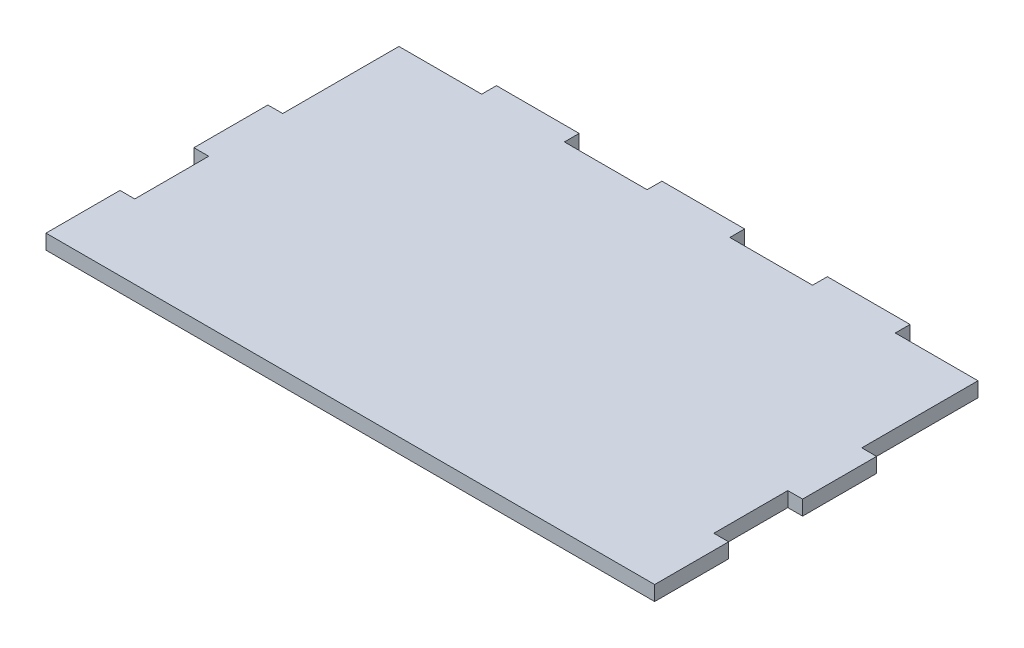
ISO-10303-21;
HEADER;
FILE_DESCRIPTION(('STEP AP214'),'2;1');
FILE_NAME('part.step','',(''),(''),'','','');
FILE_SCHEMA(('AUTOMOTIVE_DESIGN { 1 0 10303 214 1 1 1 1 }'));
ENDSEC;
DATA;
#1=APPLICATION_CONTEXT('core data for automotive mechanical design processes');
#2=APPLICATION_PROTOCOL_DEFINITION('international standard','automotive_design',2000,#1);
#3=PRODUCT_CONTEXT('',#1,'mechanical');
#4=PRODUCT('Part','Part','',(#3));
#5=PRODUCT_RELATED_PRODUCT_CATEGORY('part','',(#4));
#6=PRODUCT_DEFINITION_FORMATION('','',#4);
#7=PRODUCT_DEFINITION_CONTEXT('part definition',#1,'design');
#8=PRODUCT_DEFINITION('design','',#6,#7);
#9=PRODUCT_DEFINITION_SHAPE('','',#8);
#10=(LENGTH_UNIT() NAMED_UNIT(*) SI_UNIT(.MILLI.,.METRE.));
#11=(NAMED_UNIT(*) PLANE_ANGLE_UNIT() SI_UNIT($,.RADIAN.));
#12=(NAMED_UNIT(*) SI_UNIT($,.STERADIAN.) SOLID_ANGLE_UNIT());
#13=UNCERTAINTY_MEASURE_WITH_UNIT(LENGTH_MEASURE(1.E-05),#10,'distance_accuracy_value','');
#14=(GEOMETRIC_REPRESENTATION_CONTEXT(3) GLOBAL_UNCERTAINTY_ASSIGNED_CONTEXT((#13)) GLOBAL_UNIT_ASSIGNED_CONTEXT((#10,
#11,#12)) REPRESENTATION_CONTEXT('',''));
#15=CARTESIAN_POINT('',(0.,0.,0.));
#16=DIRECTION('',(0.,0.,1.));
#17=DIRECTION('',(1.,0.,0.));
#18=AXIS2_PLACEMENT_3D('',#15,#16,#17);
#19=CARTESIAN_POINT('',(0.,1.75,0.));
#20=DIRECTION('',(0.,0.,-1.));
#21=DIRECTION('',(-1.,0.,0.));
#22=AXIS2_PLACEMENT_3D('',#19,#20,#21);
#23=PLANE('',#22);
#24=DIRECTION('',(1.,0.,0.));
#25=VECTOR('',#24,1.);
#26=CARTESIAN_POINT('',(0.,0.,0.));
#27=LINE('',#26,#25);
#28=CARTESIAN_POINT('',(-1.75,0.,0.));
#29=VERTEX_POINT('',#28);
#30=CARTESIAN_POINT('',(70.25,0.,0.));
#31=VERTEX_POINT('',#30);
#32=EDGE_CURVE('E373',#29,#31,#27,.T.);
#33=ORIENTED_EDGE('',*,*,#32,.T.);
#34=DIRECTION('',(0.,-1.,0.));
#35=VECTOR('',#34,1.);
#36=CARTESIAN_POINT('',(70.25,1.75,0.));
#37=LINE('',#36,#35);
#38=CARTESIAN_POINT('',(70.25,1.75,0.));
#39=VERTEX_POINT('',#38);
#40=EDGE_CURVE('E11',#39,#31,#37,.T.);
#41=ORIENTED_EDGE('',*,*,#40,.F.);
#42=DIRECTION('',(1.,0.,0.));
#43=VECTOR('',#42,1.);
#44=CARTESIAN_POINT('',(0.,1.75,0.));
#45=LINE('',#44,#43);
#46=CARTESIAN_POINT('',(-1.75,1.75,0.));
#47=VERTEX_POINT('',#46);
#48=EDGE_CURVE('E439',#47,#39,#45,.T.);
#49=ORIENTED_EDGE('',*,*,#48,.F.);
#50=DIRECTION('',(0.,-1.,0.));
#51=VECTOR('',#50,1.);
#52=CARTESIAN_POINT('',(-1.75,1.75,0.));
#53=LINE('',#52,#51);
#54=EDGE_CURVE('E54',#47,#29,#53,.T.);
#55=ORIENTED_EDGE('',*,*,#54,.T.);
#56=EDGE_LOOP('',(#33,#41,#49,#55));
#57=FACE_BOUND('',#56,.T.);
#58=ADVANCED_FACE('F38',(#57),#23,.F.);
#59=CARTESIAN_POINT('',(70.25,1.75,0.));
#60=DIRECTION('',(-1.,0.,0.));
#61=DIRECTION('',(0.,0.,1.));
#62=AXIS2_PLACEMENT_3D('',#59,#60,#61);
#63=PLANE('',#62);
#64=DIRECTION('',(0.,0.,-1.));
#65=VECTOR('',#64,1.);
#66=CARTESIAN_POINT('',(70.25,0.,0.));
#67=LINE('',#66,#65);
#68=CARTESIAN_POINT('',(70.25,0.,-8.75));
#69=VERTEX_POINT('',#68);
#70=EDGE_CURVE('E369',#31,#69,#67,.T.);
#71=ORIENTED_EDGE('',*,*,#70,.T.);
#72=DIRECTION('',(0.,-1.,0.));
#73=VECTOR('',#72,1.);
#74=CARTESIAN_POINT('',(70.25,1.75,-8.75));
#75=LINE('',#74,#73);
#76=CARTESIAN_POINT('',(70.25,1.75,-8.75));
#77=VERTEX_POINT('',#76);
#78=EDGE_CURVE('E46',#77,#69,#75,.T.);
#79=ORIENTED_EDGE('',*,*,#78,.F.);
#80=DIRECTION('',(0.,0.,-1.));
#81=VECTOR('',#80,1.);
#82=CARTESIAN_POINT('',(70.25,1.75,0.));
#83=LINE('',#82,#81);
#84=EDGE_CURVE('E153',#39,#77,#83,.T.);
#85=ORIENTED_EDGE('',*,*,#84,.F.);
#86=ORIENTED_EDGE('',*,*,#40,.T.);
#87=EDGE_LOOP('',(#71,#79,#85,#86));
#88=FACE_BOUND('',#87,.T.);
#89=ADVANCED_FACE('F370',(#88),#63,.F.);
#90=CARTESIAN_POINT('',(0.,1.75,-8.75000000000028));
#91=DIRECTION('',(0.,0.,-1.));
#92=DIRECTION('',(-1.,0.,0.));
#93=AXIS2_PLACEMENT_3D('',#90,#91,#92);
#94=PLANE('',#93);
#95=DIRECTION('',(1.,0.,0.));
#96=VECTOR('',#95,1.);
#97=CARTESIAN_POINT('',(0.,0.,-8.75000000000028));
#98=LINE('',#97,#96);
#99=CARTESIAN_POINT('',(68.5,0.,-8.75));
#100=VERTEX_POINT('',#99);
#101=EDGE_CURVE('E366',#100,#69,#98,.T.);
#102=ORIENTED_EDGE('',*,*,#101,.F.);
#103=DIRECTION('',(0.,-1.,0.));
#104=VECTOR('',#103,1.);
#105=CARTESIAN_POINT('',(68.5,1.75,-8.75));
#106=LINE('',#105,#104);
#107=CARTESIAN_POINT('',(68.5,1.75,-8.75));
#108=VERTEX_POINT('',#107);
#109=EDGE_CURVE('E359',#108,#100,#106,.T.);
#110=ORIENTED_EDGE('',*,*,#109,.F.);
#111=DIRECTION('',(1.,0.,0.));
#112=VECTOR('',#111,1.);
#113=CARTESIAN_POINT('',(0.,1.75,-8.75000000000028));
#114=LINE('',#113,#112);
#115=EDGE_CURVE('E368',#108,#77,#114,.T.);
#116=ORIENTED_EDGE('',*,*,#115,.T.);
#117=ORIENTED_EDGE('',*,*,#78,.T.);
#118=EDGE_LOOP('',(#102,#110,#116,#117));
#119=FACE_BOUND('',#118,.T.);
#120=ADVANCED_FACE('F364',(#119),#94,.T.);
#121=CARTESIAN_POINT('',(68.5,1.75,0.));
#122=DIRECTION('',(-1.,0.,0.));
#123=DIRECTION('',(0.,0.,1.));
#124=AXIS2_PLACEMENT_3D('',#121,#122,#123);
#125=PLANE('',#124);
#126=DIRECTION('',(0.,0.,-1.));
#127=VECTOR('',#126,1.);
#128=CARTESIAN_POINT('',(68.5,0.,0.));
#129=LINE('',#128,#127);
#130=CARTESIAN_POINT('',(68.5,0.,-17.5));
#131=VERTEX_POINT('',#130);
#132=EDGE_CURVE('E378',#100,#131,#129,.T.);
#133=ORIENTED_EDGE('',*,*,#132,.T.);
#134=DIRECTION('',(0.,-1.,0.));
#135=VECTOR('',#134,1.);
#136=CARTESIAN_POINT('',(68.5,1.75,-17.5));
#137=LINE('',#136,#135);
#138=CARTESIAN_POINT('',(68.5,1.75,-17.5));
#139=VERTEX_POINT('',#138);
#140=EDGE_CURVE('E356',#139,#131,#137,.T.);
#141=ORIENTED_EDGE('',*,*,#140,.F.);
#142=DIRECTION('',(0.,0.,-1.));
#143=VECTOR('',#142,1.);
#144=CARTESIAN_POINT('',(68.5,1.75,0.));
#145=LINE('',#144,#143);
#146=EDGE_CURVE('E285',#108,#139,#145,.T.);
#147=ORIENTED_EDGE('',*,*,#146,.F.);
#148=ORIENTED_EDGE('',*,*,#109,.T.);
#149=EDGE_LOOP('',(#133,#141,#147,#148));
#150=FACE_BOUND('',#149,.T.);
#151=ADVANCED_FACE('F500',(#150),#125,.F.);
#152=CARTESIAN_POINT('',(1.04083408558611E-13,1.75,-17.5000000000004));
#153=DIRECTION('',(0.,0.,-1.));
#154=DIRECTION('',(-1.,0.,0.));
#155=AXIS2_PLACEMENT_3D('',#152,#153,#154);
#156=PLANE('',#155);
#157=DIRECTION('',(1.,0.,0.));
#158=VECTOR('',#157,1.);
#159=CARTESIAN_POINT('',(1.04083408558611E-13,0.,-17.5000000000004));
#160=LINE('',#159,#158);
#161=CARTESIAN_POINT('',(70.25,0.,-17.5));
#162=VERTEX_POINT('',#161);
#163=EDGE_CURVE('E380',#131,#162,#160,.T.);
#164=ORIENTED_EDGE('',*,*,#163,.T.);
#165=DIRECTION('',(0.,-1.,0.));
#166=VECTOR('',#165,1.);
#167=CARTESIAN_POINT('',(70.25,1.75,-17.5));
#168=LINE('',#167,#166);
#169=CARTESIAN_POINT('',(70.25,1.75,-17.5));
#170=VERTEX_POINT('',#169);
#171=EDGE_CURVE('E353',#170,#162,#168,.T.);
#172=ORIENTED_EDGE('',*,*,#171,.F.);
#173=DIRECTION('',(1.,0.,0.));
#174=VECTOR('',#173,1.);
#175=CARTESIAN_POINT('',(1.04083408558611E-13,1.75,-17.5000000000004));
#176=LINE('',#175,#174);
#177=EDGE_CURVE('E497',#139,#170,#176,.T.);
#178=ORIENTED_EDGE('',*,*,#177,.F.);
#179=ORIENTED_EDGE('',*,*,#140,.T.);
#180=EDGE_LOOP('',(#164,#172,#178,#179));
#181=FACE_BOUND('',#180,.T.);
#182=ADVANCED_FACE('F494',(#181),#156,.F.);
#183=CARTESIAN_POINT('',(70.25,1.75,0.));
#184=DIRECTION('',(-1.,0.,0.));
#185=DIRECTION('',(0.,0.,1.));
#186=AXIS2_PLACEMENT_3D('',#183,#184,#185);
#187=PLANE('',#186);
#188=DIRECTION('',(0.,0.,-1.));
#189=VECTOR('',#188,1.);
#190=CARTESIAN_POINT('',(70.25,0.,0.));
#191=LINE('',#190,#189);
#192=CARTESIAN_POINT('',(70.25,0.,-26.25));
#193=VERTEX_POINT('',#192);
#194=EDGE_CURVE('E386',#162,#193,#191,.T.);
#195=ORIENTED_EDGE('',*,*,#194,.T.);
#196=DIRECTION('',(0.,-1.,0.));
#197=VECTOR('',#196,1.);
#198=CARTESIAN_POINT('',(70.25,1.75,-26.25));
#199=LINE('',#198,#197);
#200=CARTESIAN_POINT('',(70.25,1.75,-26.25));
#201=VERTEX_POINT('',#200);
#202=EDGE_CURVE('E351',#201,#193,#199,.T.);
#203=ORIENTED_EDGE('',*,*,#202,.F.);
#204=DIRECTION('',(0.,0.,-1.));
#205=VECTOR('',#204,1.);
#206=CARTESIAN_POINT('',(70.25,1.75,0.));
#207=LINE('',#206,#205);
#208=EDGE_CURVE('E506',#170,#201,#207,.T.);
#209=ORIENTED_EDGE('',*,*,#208,.F.);
#210=ORIENTED_EDGE('',*,*,#171,.T.);
#211=EDGE_LOOP('',(#195,#203,#209,#210));
#212=FACE_BOUND('',#211,.T.);
#213=ADVANCED_FACE('F491',(#212),#187,.F.);
#214=CARTESIAN_POINT('',(0.,1.75,-26.25));
#215=DIRECTION('',(0.,0.,-1.));
#216=DIRECTION('',(-1.,0.,0.));
#217=AXIS2_PLACEMENT_3D('',#214,#215,#216);
#218=PLANE('',#217);
#219=DIRECTION('',(1.,0.,0.));
#220=VECTOR('',#219,1.);
#221=CARTESIAN_POINT('',(0.,0.,-26.25));
#222=LINE('',#221,#220);
#223=CARTESIAN_POINT('',(68.5,0.,-26.25));
#224=VERTEX_POINT('',#223);
#225=EDGE_CURVE('E389',#224,#193,#222,.T.);
#226=ORIENTED_EDGE('',*,*,#225,.F.);
#227=DIRECTION('',(0.,-1.,0.));
#228=VECTOR('',#227,1.);
#229=CARTESIAN_POINT('',(68.5,1.75,-26.25));
#230=LINE('',#229,#228);
#231=CARTESIAN_POINT('',(68.5,1.75,-26.25));
#232=VERTEX_POINT('',#231);
#233=EDGE_CURVE('E349',#232,#224,#230,.T.);
#234=ORIENTED_EDGE('',*,*,#233,.F.);
#235=DIRECTION('',(1.,0.,0.));
#236=VECTOR('',#235,1.);
#237=CARTESIAN_POINT('',(0.,1.75,-26.25));
#238=LINE('',#237,#236);
#239=EDGE_CURVE('E283',#232,#201,#238,.T.);
#240=ORIENTED_EDGE('',*,*,#239,.T.);
#241=ORIENTED_EDGE('',*,*,#202,.T.);
#242=EDGE_LOOP('',(#226,#234,#240,#241));
#243=FACE_BOUND('',#242,.T.);
#244=ADVANCED_FACE('F485',(#243),#218,.T.);
#245=CARTESIAN_POINT('',(68.5,0.,-40.));
#246=VERTEX_POINT('',#245);
#247=EDGE_CURVE('E382',#224,#246,#129,.T.);
#248=ORIENTED_EDGE('',*,*,#247,.T.);
#249=DIRECTION('',(0.,-1.,0.));
#250=VECTOR('',#249,1.);
#251=CARTESIAN_POINT('',(68.5,1.75,-40.));
#252=LINE('',#251,#250);
#253=CARTESIAN_POINT('',(68.5,1.75,-40.));
#254=VERTEX_POINT('',#253);
#255=EDGE_CURVE('E347',#254,#246,#252,.T.);
#256=ORIENTED_EDGE('',*,*,#255,.F.);
#257=EDGE_CURVE('E278',#232,#254,#145,.T.);
#258=ORIENTED_EDGE('',*,*,#257,.F.);
#259=ORIENTED_EDGE('',*,*,#233,.T.);
#260=EDGE_LOOP('',(#248,#256,#258,#259));
#261=FACE_BOUND('',#260,.T.);
#262=ADVANCED_FACE('F481',(#261),#125,.F.);
#263=CARTESIAN_POINT('',(0.,1.75,-40.));
#264=DIRECTION('',(0.,0.,-1.));
#265=DIRECTION('',(-1.,0.,0.));
#266=AXIS2_PLACEMENT_3D('',#263,#264,#265);
#267=PLANE('',#266);
#268=DIRECTION('',(1.,0.,0.));
#269=VECTOR('',#268,1.);
#270=CARTESIAN_POINT('',(0.,0.,-40.));
#271=LINE('',#270,#269);
#272=CARTESIAN_POINT('',(58.7142857142857,0.,-40.));
#273=VERTEX_POINT('',#272);
#274=EDGE_CURVE('E392',#273,#246,#271,.T.);
#275=ORIENTED_EDGE('',*,*,#274,.F.);
#276=DIRECTION('',(0.,-1.,0.));
#277=VECTOR('',#276,1.);
#278=CARTESIAN_POINT('',(58.7142857142857,1.75,-40.));
#279=LINE('',#278,#277);
#280=CARTESIAN_POINT('',(58.7142857142857,1.75,-40.));
#281=VERTEX_POINT('',#280);
#282=EDGE_CURVE('E345',#281,#273,#279,.T.);
#283=ORIENTED_EDGE('',*,*,#282,.F.);
#284=DIRECTION('',(1.,0.,0.));
#285=VECTOR('',#284,1.);
#286=CARTESIAN_POINT('',(0.,1.75,-40.));
#287=LINE('',#286,#285);
#288=EDGE_CURVE('E266',#281,#254,#287,.T.);
#289=ORIENTED_EDGE('',*,*,#288,.T.);
#290=ORIENTED_EDGE('',*,*,#255,.T.);
#291=EDGE_LOOP('',(#275,#283,#289,#290));
#292=FACE_BOUND('',#291,.T.);
#293=ADVANCED_FACE('F476',(#292),#267,.T.);
#294=CARTESIAN_POINT('',(58.7142857142857,1.75,0.));
#295=DIRECTION('',(1.,0.,0.));
#296=DIRECTION('',(0.,0.,-1.));
#297=AXIS2_PLACEMENT_3D('',#294,#295,#296);
#298=PLANE('',#297);
#299=DIRECTION('',(0.,0.,1.));
#300=VECTOR('',#299,1.);
#301=CARTESIAN_POINT('',(58.7142857142857,0.,0.));
#302=LINE('',#301,#300);
#303=CARTESIAN_POINT('',(58.7142857142857,0.,-41.75));
#304=VERTEX_POINT('',#303);
#305=EDGE_CURVE('E395',#304,#273,#302,.T.);
#306=ORIENTED_EDGE('',*,*,#305,.F.);
#307=DIRECTION('',(0.,-1.,0.));
#308=VECTOR('',#307,1.);
#309=CARTESIAN_POINT('',(58.7142857142857,1.75,-41.75));
#310=LINE('',#309,#308);
#311=CARTESIAN_POINT('',(58.7142857142857,1.75,-41.75));
#312=VERTEX_POINT('',#311);
#313=EDGE_CURVE('E343',#312,#304,#310,.T.);
#314=ORIENTED_EDGE('',*,*,#313,.F.);
#315=DIRECTION('',(0.,0.,1.));
#316=VECTOR('',#315,1.);
#317=CARTESIAN_POINT('',(58.7142857142857,1.75,0.));
#318=LINE('',#317,#316);
#319=EDGE_CURVE('E277',#312,#281,#318,.T.);
#320=ORIENTED_EDGE('',*,*,#319,.T.);
#321=ORIENTED_EDGE('',*,*,#282,.T.);
#322=EDGE_LOOP('',(#306,#314,#320,#321));
#323=FACE_BOUND('',#322,.T.);
#324=ADVANCED_FACE('F474',(#323),#298,.T.);
#325=CARTESIAN_POINT('',(0.,1.75,-41.75));
#326=DIRECTION('',(0.,0.,-1.));
#327=DIRECTION('',(-1.,0.,0.));
#328=AXIS2_PLACEMENT_3D('',#325,#326,#327);
#329=PLANE('',#328);
#330=DIRECTION('',(1.,0.,0.));
#331=VECTOR('',#330,1.);
#332=CARTESIAN_POINT('',(0.,0.,-41.75));
#333=LINE('',#332,#331);
#334=CARTESIAN_POINT('',(48.9285714285714,0.,-41.75));
#335=VERTEX_POINT('',#334);
#336=EDGE_CURVE('E400',#335,#304,#333,.T.);
#337=ORIENTED_EDGE('',*,*,#336,.F.);
#338=DIRECTION('',(0.,-1.,0.));
#339=VECTOR('',#338,1.);
#340=CARTESIAN_POINT('',(48.9285714285714,1.75,-41.75));
#341=LINE('',#340,#339);
#342=CARTESIAN_POINT('',(48.9285714285714,1.75,-41.75));
#343=VERTEX_POINT('',#342);
#344=EDGE_CURVE('E341',#343,#335,#341,.T.);
#345=ORIENTED_EDGE('',*,*,#344,.F.);
#346=DIRECTION('',(1.,0.,0.));
#347=VECTOR('',#346,1.);
#348=CARTESIAN_POINT('',(0.,1.75,-41.75));
#349=LINE('',#348,#347);
#350=EDGE_CURVE('E282',#343,#312,#349,.T.);
#351=ORIENTED_EDGE('',*,*,#350,.T.);
#352=ORIENTED_EDGE('',*,*,#313,.T.);
#353=EDGE_LOOP('',(#337,#345,#351,#352));
#354=FACE_BOUND('',#353,.T.);
#355=ADVANCED_FACE('F469',(#354),#329,.T.);
#356=CARTESIAN_POINT('',(48.9285714285714,1.75,0.));
#357=DIRECTION('',(1.,0.,0.));
#358=DIRECTION('',(0.,0.,-1.));
#359=AXIS2_PLACEMENT_3D('',#356,#357,#358);
#360=PLANE('',#359);
#361=DIRECTION('',(0.,0.,1.));
#362=VECTOR('',#361,1.);
#363=CARTESIAN_POINT('',(48.9285714285714,0.,0.));
#364=LINE('',#363,#362);
#365=CARTESIAN_POINT('',(48.9285714285714,0.,-40.));
#366=VERTEX_POINT('',#365);
#367=EDGE_CURVE('E403',#335,#366,#364,.T.);
#368=ORIENTED_EDGE('',*,*,#367,.T.);
#369=DIRECTION('',(0.,-1.,0.));
#370=VECTOR('',#369,1.);
#371=CARTESIAN_POINT('',(48.9285714285714,1.75,-40.));
#372=LINE('',#371,#370);
#373=CARTESIAN_POINT('',(48.9285714285714,1.75,-40.));
#374=VERTEX_POINT('',#373);
#375=EDGE_CURVE('E339',#374,#366,#372,.T.);
#376=ORIENTED_EDGE('',*,*,#375,.F.);
#377=DIRECTION('',(0.,0.,1.));
#378=VECTOR('',#377,1.);
#379=CARTESIAN_POINT('',(48.9285714285714,1.75,0.));
#380=LINE('',#379,#378);
#381=EDGE_CURVE('E288',#343,#374,#380,.T.);
#382=ORIENTED_EDGE('',*,*,#381,.F.);
#383=ORIENTED_EDGE('',*,*,#344,.T.);
#384=EDGE_LOOP('',(#368,#376,#382,#383));
#385=FACE_BOUND('',#384,.T.);
#386=ADVANCED_FACE('F467',(#385),#360,.F.);
#387=CARTESIAN_POINT('',(39.1428571428571,0.,-40.));
#388=VERTEX_POINT('',#387);
#389=EDGE_CURVE('E397',#388,#366,#271,.T.);
#390=ORIENTED_EDGE('',*,*,#389,.F.);
#391=DIRECTION('',(0.,-1.,0.));
#392=VECTOR('',#391,1.);
#393=CARTESIAN_POINT('',(39.1428571428571,1.75,-40.));
#394=LINE('',#393,#392);
#395=CARTESIAN_POINT('',(39.1428571428571,1.75,-40.));
#396=VERTEX_POINT('',#395);
#397=EDGE_CURVE('E337',#396,#388,#394,.T.);
#398=ORIENTED_EDGE('',*,*,#397,.F.);
#399=EDGE_CURVE('E275',#396,#374,#287,.T.);
#400=ORIENTED_EDGE('',*,*,#399,.T.);
#401=ORIENTED_EDGE('',*,*,#375,.T.);
#402=EDGE_LOOP('',(#390,#398,#400,#401));
#403=FACE_BOUND('',#402,.T.);
#404=ADVANCED_FACE('F465',(#403),#267,.T.);
#405=CARTESIAN_POINT('',(39.1428571428571,1.75,0.));
#406=DIRECTION('',(1.,0.,0.));
#407=DIRECTION('',(0.,0.,-1.));
#408=AXIS2_PLACEMENT_3D('',#405,#406,#407);
#409=PLANE('',#408);
#410=DIRECTION('',(0.,0.,1.));
#411=VECTOR('',#410,1.);
#412=CARTESIAN_POINT('',(39.1428571428571,0.,0.));
#413=LINE('',#412,#411);
#414=CARTESIAN_POINT('',(39.1428571428571,0.,-41.75));
#415=VERTEX_POINT('',#414);
#416=EDGE_CURVE('E406',#415,#388,#413,.T.);
#417=ORIENTED_EDGE('',*,*,#416,.F.);
#418=DIRECTION('',(0.,-1.,0.));
#419=VECTOR('',#418,1.);
#420=CARTESIAN_POINT('',(39.1428571428571,1.75,-41.75));
#421=LINE('',#420,#419);
#422=CARTESIAN_POINT('',(39.1428571428571,1.75,-41.75));
#423=VERTEX_POINT('',#422);
#424=EDGE_CURVE('E335',#423,#415,#421,.T.);
#425=ORIENTED_EDGE('',*,*,#424,.F.);
#426=DIRECTION('',(0.,0.,1.));
#427=VECTOR('',#426,1.);
#428=CARTESIAN_POINT('',(39.1428571428571,1.75,0.));
#429=LINE('',#428,#427);
#430=EDGE_CURVE('E287',#423,#396,#429,.T.);
#431=ORIENTED_EDGE('',*,*,#430,.T.);
#432=ORIENTED_EDGE('',*,*,#397,.T.);
#433=EDGE_LOOP('',(#417,#425,#431,#432));
#434=FACE_BOUND('',#433,.T.);
#435=ADVANCED_FACE('F551',(#434),#409,.T.);
#436=CARTESIAN_POINT('',(0.,1.75,-41.75));
#437=DIRECTION('',(0.,0.,-1.));
#438=DIRECTION('',(-1.,0.,0.));
#439=AXIS2_PLACEMENT_3D('',#436,#437,#438);
#440=PLANE('',#439);
#441=DIRECTION('',(1.,0.,0.));
#442=VECTOR('',#441,1.);
#443=CARTESIAN_POINT('',(0.,0.,-41.75));
#444=LINE('',#443,#442);
#445=CARTESIAN_POINT('',(29.3571428571429,0.,-41.75));
#446=VERTEX_POINT('',#445);
#447=EDGE_CURVE('E409',#446,#415,#444,.T.);
#448=ORIENTED_EDGE('',*,*,#447,.F.);
#449=DIRECTION('',(0.,-1.,0.));
#450=VECTOR('',#449,1.);
#451=CARTESIAN_POINT('',(29.3571428571429,1.75,-41.75));
#452=LINE('',#451,#450);
#453=CARTESIAN_POINT('',(29.3571428571429,1.75,-41.75));
#454=VERTEX_POINT('',#453);
#455=EDGE_CURVE('E333',#454,#446,#452,.T.);
#456=ORIENTED_EDGE('',*,*,#455,.F.);
#457=DIRECTION('',(1.,0.,0.));
#458=VECTOR('',#457,1.);
#459=CARTESIAN_POINT('',(0.,1.75,-41.75));
#460=LINE('',#459,#458);
#461=EDGE_CURVE('E292',#454,#423,#460,.T.);
#462=ORIENTED_EDGE('',*,*,#461,.T.);
#463=ORIENTED_EDGE('',*,*,#424,.T.);
#464=EDGE_LOOP('',(#448,#456,#462,#463));
#465=FACE_BOUND('',#464,.T.);
#466=ADVANCED_FACE('F554',(#465),#440,.T.);
#467=CARTESIAN_POINT('',(29.3571428571429,1.75,0.));
#468=DIRECTION('',(1.,0.,0.));
#469=DIRECTION('',(0.,0.,-1.));
#470=AXIS2_PLACEMENT_3D('',#467,#468,#469);
#471=PLANE('',#470);
#472=DIRECTION('',(0.,0.,1.));
#473=VECTOR('',#472,1.);
#474=CARTESIAN_POINT('',(29.3571428571429,0.,0.));
#475=LINE('',#474,#473);
#476=CARTESIAN_POINT('',(29.3571428571429,0.,-40.));
#477=VERTEX_POINT('',#476);
#478=EDGE_CURVE('E412',#446,#477,#475,.T.);
#479=ORIENTED_EDGE('',*,*,#478,.T.);
#480=DIRECTION('',(0.,-1.,0.));
#481=VECTOR('',#480,1.);
#482=CARTESIAN_POINT('',(29.3571428571429,1.75,-40.));
#483=LINE('',#482,#481);
#484=CARTESIAN_POINT('',(29.3571428571429,1.75,-40.));
#485=VERTEX_POINT('',#484);
#486=EDGE_CURVE('E326',#485,#477,#483,.T.);
#487=ORIENTED_EDGE('',*,*,#486,.F.);
#488=DIRECTION('',(0.,0.,1.));
#489=VECTOR('',#488,1.);
#490=CARTESIAN_POINT('',(29.3571428571429,1.75,0.));
#491=LINE('',#490,#489);
#492=EDGE_CURVE('E274',#454,#485,#491,.T.);
#493=ORIENTED_EDGE('',*,*,#492,.F.);
#494=ORIENTED_EDGE('',*,*,#455,.T.);
#495=EDGE_LOOP('',(#479,#487,#493,#494));
#496=FACE_BOUND('',#495,.T.);
#497=ADVANCED_FACE('F558',(#496),#471,.F.);
#498=CARTESIAN_POINT('',(19.5714285714286,0.,-40.));
#499=VERTEX_POINT('',#498);
#500=EDGE_CURVE('E415',#499,#477,#271,.T.);
#501=ORIENTED_EDGE('',*,*,#500,.F.);
#502=DIRECTION('',(0.,-1.,0.));
#503=VECTOR('',#502,1.);
#504=CARTESIAN_POINT('',(19.5714285714286,1.75,-40.));
#505=LINE('',#504,#503);
#506=CARTESIAN_POINT('',(19.5714285714286,1.75,-40.));
#507=VERTEX_POINT('',#506);
#508=EDGE_CURVE('E320',#507,#499,#505,.T.);
#509=ORIENTED_EDGE('',*,*,#508,.F.);
#510=EDGE_CURVE('E265',#507,#485,#287,.T.);
#511=ORIENTED_EDGE('',*,*,#510,.T.);
#512=ORIENTED_EDGE('',*,*,#486,.T.);
#513=EDGE_LOOP('',(#501,#509,#511,#512));
#514=FACE_BOUND('',#513,.T.);
#515=ADVANCED_FACE('F562',(#514),#267,.T.);
#516=CARTESIAN_POINT('',(19.5714285714286,1.75,0.));
#517=DIRECTION('',(1.,0.,0.));
#518=DIRECTION('',(0.,0.,-1.));
#519=AXIS2_PLACEMENT_3D('',#516,#517,#518);
#520=PLANE('',#519);
#521=DIRECTION('',(0.,0.,1.));
#522=VECTOR('',#521,1.);
#523=CARTESIAN_POINT('',(19.5714285714286,0.,0.));
#524=LINE('',#523,#522);
#525=CARTESIAN_POINT('',(19.5714285714286,0.,-41.75));
#526=VERTEX_POINT('',#525);
#527=EDGE_CURVE('E323',#526,#499,#524,.T.);
#528=ORIENTED_EDGE('',*,*,#527,.F.);
#529=DIRECTION('',(0.,-1.,0.));
#530=VECTOR('',#529,1.);
#531=CARTESIAN_POINT('',(19.5714285714286,1.75,-41.75));
#532=LINE('',#531,#530);
#533=CARTESIAN_POINT('',(19.5714285714286,1.75,-41.75));
#534=VERTEX_POINT('',#533);
#535=EDGE_CURVE('E311',#534,#526,#532,.T.);
#536=ORIENTED_EDGE('',*,*,#535,.F.);
#537=DIRECTION('',(0.,0.,1.));
#538=VECTOR('',#537,1.);
#539=CARTESIAN_POINT('',(19.5714285714286,1.75,0.));
#540=LINE('',#539,#538);
#541=EDGE_CURVE('E273',#534,#507,#540,.T.);
#542=ORIENTED_EDGE('',*,*,#541,.T.);
#543=ORIENTED_EDGE('',*,*,#508,.T.);
#544=EDGE_LOOP('',(#528,#536,#542,#543));
#545=FACE_BOUND('',#544,.T.);
#546=ADVANCED_FACE('F319',(#545),#520,.T.);
#547=CARTESIAN_POINT('',(0.,1.75,-41.75));
#548=DIRECTION('',(0.,0.,-1.));
#549=DIRECTION('',(-1.,0.,0.));
#550=AXIS2_PLACEMENT_3D('',#547,#548,#549);
#551=PLANE('',#550);
#552=DIRECTION('',(1.,0.,0.));
#553=VECTOR('',#552,1.);
#554=CARTESIAN_POINT('',(0.,0.,-41.75));
#555=LINE('',#554,#553);
#556=CARTESIAN_POINT('',(9.78571428571429,0.,-41.75));
#557=VERTEX_POINT('',#556);
#558=EDGE_CURVE('E417',#557,#526,#555,.T.);
#559=ORIENTED_EDGE('',*,*,#558,.F.);
#560=DIRECTION('',(0.,-1.,0.));
#561=VECTOR('',#560,1.);
#562=CARTESIAN_POINT('',(9.78571428571429,1.75,-41.75));
#563=LINE('',#562,#561);
#564=CARTESIAN_POINT('',(9.78571428571429,1.75,-41.75));
#565=VERTEX_POINT('',#564);
#566=EDGE_CURVE('E313',#565,#557,#563,.T.);
#567=ORIENTED_EDGE('',*,*,#566,.F.);
#568=DIRECTION('',(1.,0.,0.));
#569=VECTOR('',#568,1.);
#570=CARTESIAN_POINT('',(0.,1.75,-41.75));
#571=LINE('',#570,#569);
#572=EDGE_CURVE('E269',#565,#534,#571,.T.);
#573=ORIENTED_EDGE('',*,*,#572,.T.);
#574=ORIENTED_EDGE('',*,*,#535,.T.);
#575=EDGE_LOOP('',(#559,#567,#573,#574));
#576=FACE_BOUND('',#575,.T.);
#577=ADVANCED_FACE('F310',(#576),#551,.T.);
#578=CARTESIAN_POINT('',(9.78571428571429,1.75,0.));
#579=DIRECTION('',(1.,0.,0.));
#580=DIRECTION('',(0.,0.,-1.));
#581=AXIS2_PLACEMENT_3D('',#578,#579,#580);
#582=PLANE('',#581);
#583=DIRECTION('',(0.,0.,1.));
#584=VECTOR('',#583,1.);
#585=CARTESIAN_POINT('',(9.78571428571429,0.,0.));
#586=LINE('',#585,#584);
#587=CARTESIAN_POINT('',(9.78571428571429,0.,-40.));
#588=VERTEX_POINT('',#587);
#589=EDGE_CURVE('E419',#557,#588,#586,.T.);
#590=ORIENTED_EDGE('',*,*,#589,.T.);
#591=DIRECTION('',(0.,-1.,0.));
#592=VECTOR('',#591,1.);
#593=CARTESIAN_POINT('',(9.78571428571429,1.75,-40.));
#594=LINE('',#593,#592);
#595=CARTESIAN_POINT('',(9.78571428571429,1.75,-40.));
#596=VERTEX_POINT('',#595);
#597=EDGE_CURVE('E328',#596,#588,#594,.T.);
#598=ORIENTED_EDGE('',*,*,#597,.F.);
#599=DIRECTION('',(0.,0.,1.));
#600=VECTOR('',#599,1.);
#601=CARTESIAN_POINT('',(9.78571428571429,1.75,0.));
#602=LINE('',#601,#600);
#603=EDGE_CURVE('E263',#565,#596,#602,.T.);
#604=ORIENTED_EDGE('',*,*,#603,.F.);
#605=ORIENTED_EDGE('',*,*,#566,.T.);
#606=EDGE_LOOP('',(#590,#598,#604,#605));
#607=FACE_BOUND('',#606,.T.);
#608=ADVANCED_FACE('F455',(#607),#582,.F.);
#609=CARTESIAN_POINT('',(0.,0.,-40.));
#610=VERTEX_POINT('',#609);
#611=EDGE_CURVE('E396',#610,#588,#271,.T.);
#612=ORIENTED_EDGE('',*,*,#611,.F.);
#613=DIRECTION('',(0.,-1.,0.));
#614=VECTOR('',#613,1.);
#615=CARTESIAN_POINT('',(0.,1.75,-40.));
#616=LINE('',#615,#614);
#617=CARTESIAN_POINT('',(0.,1.75,-40.));
#618=VERTEX_POINT('',#617);
#619=EDGE_CURVE('E449',#618,#610,#616,.T.);
#620=ORIENTED_EDGE('',*,*,#619,.F.);
#621=EDGE_CURVE('E259',#618,#596,#287,.T.);
#622=ORIENTED_EDGE('',*,*,#621,.T.);
#623=ORIENTED_EDGE('',*,*,#597,.T.);
#624=EDGE_LOOP('',(#612,#620,#622,#623));
#625=FACE_BOUND('',#624,.T.);
#626=ADVANCED_FACE('F451',(#625),#267,.T.);
#627=CARTESIAN_POINT('',(0.,1.75,0.));
#628=DIRECTION('',(-1.,0.,0.));
#629=DIRECTION('',(0.,0.,1.));
#630=AXIS2_PLACEMENT_3D('',#627,#628,#629);
#631=PLANE('',#630);
#632=DIRECTION('',(0.,0.,-1.));
#633=VECTOR('',#632,1.);
#634=CARTESIAN_POINT('',(0.,0.,0.));
#635=LINE('',#634,#633);
#636=CARTESIAN_POINT('',(0.,0.,-26.25));
#637=VERTEX_POINT('',#636);
#638=EDGE_CURVE('E422',#637,#610,#635,.T.);
#639=ORIENTED_EDGE('',*,*,#638,.F.);
#640=DIRECTION('',(0.,-1.,0.));
#641=VECTOR('',#640,1.);
#642=CARTESIAN_POINT('',(0.,1.75,-26.25));
#643=LINE('',#642,#641);
#644=CARTESIAN_POINT('',(0.,1.75,-26.25));
#645=VERTEX_POINT('',#644);
#646=EDGE_CURVE('E447',#645,#637,#643,.T.);
#647=ORIENTED_EDGE('',*,*,#646,.F.);
#648=DIRECTION('',(0.,0.,-1.));
#649=VECTOR('',#648,1.);
#650=CARTESIAN_POINT('',(0.,1.75,0.));
#651=LINE('',#650,#649);
#652=EDGE_CURVE('E252',#645,#618,#651,.T.);
#653=ORIENTED_EDGE('',*,*,#652,.T.);
#654=ORIENTED_EDGE('',*,*,#619,.T.);
#655=EDGE_LOOP('',(#639,#647,#653,#654));
#656=FACE_BOUND('',#655,.T.);
#657=ADVANCED_FACE('F572',(#656),#631,.T.);
#658=CARTESIAN_POINT('',(0.,1.75,-26.25));
#659=DIRECTION('',(0.,0.,1.));
#660=DIRECTION('',(1.,0.,0.));
#661=AXIS2_PLACEMENT_3D('',#658,#659,#660);
#662=PLANE('',#661);
#663=DIRECTION('',(-1.,0.,0.));
#664=VECTOR('',#663,1.);
#665=CARTESIAN_POINT('',(0.,0.,-26.25));
#666=LINE('',#665,#664);
#667=CARTESIAN_POINT('',(-1.75,0.,-26.25));
#668=VERTEX_POINT('',#667);
#669=EDGE_CURVE('E425',#637,#668,#666,.T.);
#670=ORIENTED_EDGE('',*,*,#669,.T.);
#671=DIRECTION('',(0.,-1.,0.));
#672=VECTOR('',#671,1.);
#673=CARTESIAN_POINT('',(-1.75,1.75,-26.25));
#674=LINE('',#673,#672);
#675=CARTESIAN_POINT('',(-1.75,1.75,-26.25));
#676=VERTEX_POINT('',#675);
#677=EDGE_CURVE('E445',#676,#668,#674,.T.);
#678=ORIENTED_EDGE('',*,*,#677,.F.);
#679=DIRECTION('',(-1.,0.,0.));
#680=VECTOR('',#679,1.);
#681=CARTESIAN_POINT('',(0.,1.75,-26.25));
#682=LINE('',#681,#680);
#683=EDGE_CURVE('E258',#645,#676,#682,.T.);
#684=ORIENTED_EDGE('',*,*,#683,.F.);
#685=ORIENTED_EDGE('',*,*,#646,.T.);
#686=EDGE_LOOP('',(#670,#678,#684,#685));
#687=FACE_BOUND('',#686,.T.);
#688=ADVANCED_FACE('F573',(#687),#662,.F.);
#689=CARTESIAN_POINT('',(-1.75,1.75,0.));
#690=DIRECTION('',(-1.,0.,0.));
#691=DIRECTION('',(0.,0.,1.));
#692=AXIS2_PLACEMENT_3D('',#689,#690,#691);
#693=PLANE('',#692);
#694=DIRECTION('',(0.,0.,-1.));
#695=VECTOR('',#694,1.);
#696=CARTESIAN_POINT('',(-1.75,0.,0.));
#697=LINE('',#696,#695);
#698=CARTESIAN_POINT('',(-1.75,0.,-17.5));
#699=VERTEX_POINT('',#698);
#700=EDGE_CURVE('E428',#699,#668,#697,.T.);
#701=ORIENTED_EDGE('',*,*,#700,.F.);
#702=DIRECTION('',(0.,-1.,0.));
#703=VECTOR('',#702,1.);
#704=CARTESIAN_POINT('',(-1.75,1.75,-17.5));
#705=LINE('',#704,#703);
#706=CARTESIAN_POINT('',(-1.75,1.75,-17.5));
#707=VERTEX_POINT('',#706);
#708=EDGE_CURVE('E443',#707,#699,#705,.T.);
#709=ORIENTED_EDGE('',*,*,#708,.F.);
#710=DIRECTION('',(0.,0.,-1.));
#711=VECTOR('',#710,1.);
#712=CARTESIAN_POINT('',(-1.75,1.75,0.));
#713=LINE('',#712,#711);
#714=EDGE_CURVE('E253',#707,#676,#713,.T.);
#715=ORIENTED_EDGE('',*,*,#714,.T.);
#716=ORIENTED_EDGE('',*,*,#677,.T.);
#717=EDGE_LOOP('',(#701,#709,#715,#716));
#718=FACE_BOUND('',#717,.T.);
#719=ADVANCED_FACE('F512',(#718),#693,.T.);
#720=CARTESIAN_POINT('',(0.,1.75,-17.5));
#721=DIRECTION('',(0.,0.,1.));
#722=DIRECTION('',(1.,0.,0.));
#723=AXIS2_PLACEMENT_3D('',#720,#721,#722);
#724=PLANE('',#723);
#725=DIRECTION('',(-1.,0.,0.));
#726=VECTOR('',#725,1.);
#727=CARTESIAN_POINT('',(0.,0.,-17.5));
#728=LINE('',#727,#726);
#729=CARTESIAN_POINT('',(0.,0.,-17.5));
#730=VERTEX_POINT('',#729);
#731=EDGE_CURVE('E431',#730,#699,#728,.T.);
#732=ORIENTED_EDGE('',*,*,#731,.F.);
#733=DIRECTION('',(0.,-1.,0.));
#734=VECTOR('',#733,1.);
#735=CARTESIAN_POINT('',(0.,1.75,-17.5));
#736=LINE('',#735,#734);
#737=CARTESIAN_POINT('',(0.,1.75,-17.5));
#738=VERTEX_POINT('',#737);
#739=EDGE_CURVE('E238',#738,#730,#736,.T.);
#740=ORIENTED_EDGE('',*,*,#739,.F.);
#741=DIRECTION('',(-1.,0.,0.));
#742=VECTOR('',#741,1.);
#743=CARTESIAN_POINT('',(0.,1.75,-17.5));
#744=LINE('',#743,#742);
#745=EDGE_CURVE('E250',#738,#707,#744,.T.);
#746=ORIENTED_EDGE('',*,*,#745,.T.);
#747=ORIENTED_EDGE('',*,*,#708,.T.);
#748=EDGE_LOOP('',(#732,#740,#746,#747));
#749=FACE_BOUND('',#748,.T.);
#750=ADVANCED_FACE('F517',(#749),#724,.T.);
#751=CARTESIAN_POINT('',(0.,0.,-8.75000000000001));
#752=VERTEX_POINT('',#751);
#753=EDGE_CURVE('E235',#752,#730,#635,.T.);
#754=ORIENTED_EDGE('',*,*,#753,.F.);
#755=DIRECTION('',(0.,-1.,0.));
#756=VECTOR('',#755,1.);
#757=CARTESIAN_POINT('',(0.,1.75,-8.75000000000001));
#758=LINE('',#757,#756);
#759=CARTESIAN_POINT('',(0.,1.75,-8.75000000000001));
#760=VERTEX_POINT('',#759);
#761=EDGE_CURVE('E229',#760,#752,#758,.T.);
#762=ORIENTED_EDGE('',*,*,#761,.F.);
#763=EDGE_CURVE('E233',#760,#738,#651,.T.);
#764=ORIENTED_EDGE('',*,*,#763,.T.);
#765=ORIENTED_EDGE('',*,*,#739,.T.);
#766=EDGE_LOOP('',(#754,#762,#764,#765));
#767=FACE_BOUND('',#766,.T.);
#768=ADVANCED_FACE('F231',(#767),#631,.T.);
#769=CARTESIAN_POINT('',(0.,1.75,-8.75000000000001));
#770=DIRECTION('',(0.,0.,1.));
#771=DIRECTION('',(1.,0.,0.));
#772=AXIS2_PLACEMENT_3D('',#769,#770,#771);
#773=PLANE('',#772);
#774=DIRECTION('',(-1.,0.,0.));
#775=VECTOR('',#774,1.);
#776=CARTESIAN_POINT('',(0.,0.,-8.75000000000001));
#777=LINE('',#776,#775);
#778=CARTESIAN_POINT('',(-1.75,0.,-8.75));
#779=VERTEX_POINT('',#778);
#780=EDGE_CURVE('E434',#752,#779,#777,.T.);
#781=ORIENTED_EDGE('',*,*,#780,.T.);
#782=DIRECTION('',(0.,-1.,0.));
#783=VECTOR('',#782,1.);
#784=CARTESIAN_POINT('',(-1.75,1.75,-8.75));
#785=LINE('',#784,#783);
#786=CARTESIAN_POINT('',(-1.75,1.75,-8.75));
#787=VERTEX_POINT('',#786);
#788=EDGE_CURVE('E141',#787,#779,#785,.T.);
#789=ORIENTED_EDGE('',*,*,#788,.F.);
#790=DIRECTION('',(-1.,0.,0.));
#791=VECTOR('',#790,1.);
#792=CARTESIAN_POINT('',(0.,1.75,-8.75000000000001));
#793=LINE('',#792,#791);
#794=EDGE_CURVE('E240',#760,#787,#793,.T.);
#795=ORIENTED_EDGE('',*,*,#794,.F.);
#796=ORIENTED_EDGE('',*,*,#761,.T.);
#797=EDGE_LOOP('',(#781,#789,#795,#796));
#798=FACE_BOUND('',#797,.T.);
#799=ADVANCED_FACE('F241',(#798),#773,.F.);
#800=CARTESIAN_POINT('',(-1.75,1.75,0.));
#801=DIRECTION('',(-1.,0.,0.));
#802=DIRECTION('',(0.,0.,1.));
#803=AXIS2_PLACEMENT_3D('',#800,#801,#802);
#804=PLANE('',#803);
#805=DIRECTION('',(0.,0.,-1.));
#806=VECTOR('',#805,1.);
#807=CARTESIAN_POINT('',(-1.75,0.,0.));
#808=LINE('',#807,#806);
#809=EDGE_CURVE('E436',#29,#779,#808,.T.);
#810=ORIENTED_EDGE('',*,*,#809,.F.);
#811=ORIENTED_EDGE('',*,*,#54,.F.);
#812=DIRECTION('',(0.,0.,-1.));
#813=VECTOR('',#812,1.);
#814=CARTESIAN_POINT('',(-1.75,1.75,0.));
#815=LINE('',#814,#813);
#816=EDGE_CURVE('E244',#47,#787,#815,.T.);
#817=ORIENTED_EDGE('',*,*,#816,.T.);
#818=ORIENTED_EDGE('',*,*,#788,.T.);
#819=EDGE_LOOP('',(#810,#811,#817,#818));
#820=FACE_BOUND('',#819,.T.);
#821=ADVANCED_FACE('F518',(#820),#804,.T.);
#822=CARTESIAN_POINT('',(0.,1.75,0.));
#823=DIRECTION('',(0.,1.,0.));
#824=DIRECTION('',(0.,0.,1.));
#825=AXIS2_PLACEMENT_3D('',#822,#823,#824);
#826=PLANE('',#825);
#827=ORIENTED_EDGE('',*,*,#48,.T.);
#828=ORIENTED_EDGE('',*,*,#84,.T.);
#829=ORIENTED_EDGE('',*,*,#115,.F.);
#830=ORIENTED_EDGE('',*,*,#146,.T.);
#831=ORIENTED_EDGE('',*,*,#177,.T.);
#832=ORIENTED_EDGE('',*,*,#208,.T.);
#833=ORIENTED_EDGE('',*,*,#239,.F.);
#834=ORIENTED_EDGE('',*,*,#257,.T.);
#835=ORIENTED_EDGE('',*,*,#288,.F.);
#836=ORIENTED_EDGE('',*,*,#319,.F.);
#837=ORIENTED_EDGE('',*,*,#350,.F.);
#838=ORIENTED_EDGE('',*,*,#381,.T.);
#839=ORIENTED_EDGE('',*,*,#399,.F.);
#840=ORIENTED_EDGE('',*,*,#430,.F.);
#841=ORIENTED_EDGE('',*,*,#461,.F.);
#842=ORIENTED_EDGE('',*,*,#492,.T.);
#843=ORIENTED_EDGE('',*,*,#510,.F.);
#844=ORIENTED_EDGE('',*,*,#541,.F.);
#845=ORIENTED_EDGE('',*,*,#572,.F.);
#846=ORIENTED_EDGE('',*,*,#603,.T.);
#847=ORIENTED_EDGE('',*,*,#621,.F.);
#848=ORIENTED_EDGE('',*,*,#652,.F.);
#849=ORIENTED_EDGE('',*,*,#683,.T.);
#850=ORIENTED_EDGE('',*,*,#714,.F.);
#851=ORIENTED_EDGE('',*,*,#745,.F.);
#852=ORIENTED_EDGE('',*,*,#763,.F.);
#853=ORIENTED_EDGE('',*,*,#794,.T.);
#854=ORIENTED_EDGE('',*,*,#816,.F.);
#855=EDGE_LOOP('',(#827,#828,#829,#830,#831,#832,#833,#834,#835,#836,#837,#838,#839,#840,#841,
#842,#843,#844,#845,#846,#847,#848,#849,#850,#851,#852,#853,#854));
#856=FACE_BOUND('',#855,.T.);
#857=ADVANCED_FACE('F247',(#856),#826,.T.);
#858=CARTESIAN_POINT('',(0.,0.,0.));
#859=DIRECTION('',(0.,1.,0.));
#860=DIRECTION('',(0.,0.,1.));
#861=AXIS2_PLACEMENT_3D('',#858,#859,#860);
#862=PLANE('',#861);
#863=ORIENTED_EDGE('',*,*,#32,.F.);
#864=ORIENTED_EDGE('',*,*,#809,.T.);
#865=ORIENTED_EDGE('',*,*,#780,.F.);
#866=ORIENTED_EDGE('',*,*,#753,.T.);
#867=ORIENTED_EDGE('',*,*,#731,.T.);
#868=ORIENTED_EDGE('',*,*,#700,.T.);
#869=ORIENTED_EDGE('',*,*,#669,.F.);
#870=ORIENTED_EDGE('',*,*,#638,.T.);
#871=ORIENTED_EDGE('',*,*,#611,.T.);
#872=ORIENTED_EDGE('',*,*,#589,.F.);
#873=ORIENTED_EDGE('',*,*,#558,.T.);
#874=ORIENTED_EDGE('',*,*,#527,.T.);
#875=ORIENTED_EDGE('',*,*,#500,.T.);
#876=ORIENTED_EDGE('',*,*,#478,.F.);
#877=ORIENTED_EDGE('',*,*,#447,.T.);
#878=ORIENTED_EDGE('',*,*,#416,.T.);
#879=ORIENTED_EDGE('',*,*,#389,.T.);
#880=ORIENTED_EDGE('',*,*,#367,.F.);
#881=ORIENTED_EDGE('',*,*,#336,.T.);
#882=ORIENTED_EDGE('',*,*,#305,.T.);
#883=ORIENTED_EDGE('',*,*,#274,.T.);
#884=ORIENTED_EDGE('',*,*,#247,.F.);
#885=ORIENTED_EDGE('',*,*,#225,.T.);
#886=ORIENTED_EDGE('',*,*,#194,.F.);
#887=ORIENTED_EDGE('',*,*,#163,.F.);
#888=ORIENTED_EDGE('',*,*,#132,.F.);
#889=ORIENTED_EDGE('',*,*,#101,.T.);
#890=ORIENTED_EDGE('',*,*,#70,.F.);
#891=EDGE_LOOP('',(#863,#864,#865,#866,#867,#868,#869,#870,#871,#872,#873,#874,#875,#876,#877,
#878,#879,#880,#881,#882,#883,#884,#885,#886,#887,#888,#889,#890));
#892=FACE_BOUND('',#891,.T.);
#893=ADVANCED_FACE('F376',(#892),#862,.F.);
#894=CLOSED_SHELL('',(#58,#89,#120,#151,#182,#213,#244,#262,#293,#324,#355,#386,#404,#435,#466,
#497,#515,#546,#577,#608,#626,#657,#688,#719,#750,#768,#799,#821,#857,#893));
#895=MANIFOLD_SOLID_BREP('B2',#894);
#896=ADVANCED_BREP_SHAPE_REPRESENTATION('',(#18,#895),#14);
#897=SHAPE_DEFINITION_REPRESENTATION(#9,#896);
ENDSEC;
END-ISO-10303-21;
